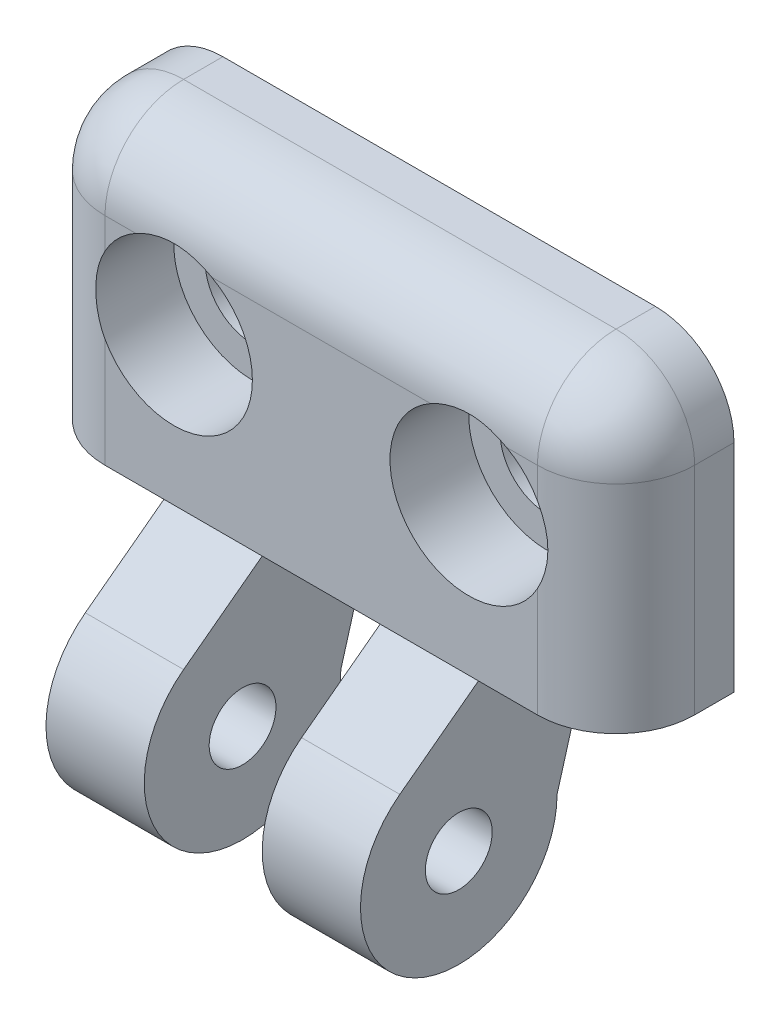
ISO-10303-21;
HEADER;
FILE_DESCRIPTION(('STEP AP214'),'2;1');
FILE_NAME('part.step','',(''),(''),'','','');
FILE_SCHEMA(('AUTOMOTIVE_DESIGN { 1 0 10303 214 1 1 1 1 }'));
ENDSEC;
DATA;
#1=APPLICATION_CONTEXT('core data for automotive mechanical design processes');
#2=APPLICATION_PROTOCOL_DEFINITION('international standard','automotive_design',2000,#1);
#3=PRODUCT_CONTEXT('',#1,'mechanical');
#4=PRODUCT('Part','Part','',(#3));
#5=PRODUCT_RELATED_PRODUCT_CATEGORY('part','',(#4));
#6=PRODUCT_DEFINITION_FORMATION('','',#4);
#7=PRODUCT_DEFINITION_CONTEXT('part definition',#1,'design');
#8=PRODUCT_DEFINITION('design','',#6,#7);
#9=PRODUCT_DEFINITION_SHAPE('','',#8);
#10=(LENGTH_UNIT() NAMED_UNIT(*) SI_UNIT(.MILLI.,.METRE.));
#11=(NAMED_UNIT(*) PLANE_ANGLE_UNIT() SI_UNIT($,.RADIAN.));
#12=(NAMED_UNIT(*) SI_UNIT($,.STERADIAN.) SOLID_ANGLE_UNIT());
#13=UNCERTAINTY_MEASURE_WITH_UNIT(LENGTH_MEASURE(1.E-05),#10,'distance_accuracy_value','');
#14=(GEOMETRIC_REPRESENTATION_CONTEXT(3) GLOBAL_UNCERTAINTY_ASSIGNED_CONTEXT((#13)) GLOBAL_UNIT_ASSIGNED_CONTEXT((#10,
#11,#12)) REPRESENTATION_CONTEXT('',''));
#15=CARTESIAN_POINT('',(0.,0.,0.));
#16=DIRECTION('',(0.,0.,1.));
#17=DIRECTION('',(1.,0.,0.));
#18=AXIS2_PLACEMENT_3D('',#15,#16,#17);
#19=CARTESIAN_POINT('',(0.,0.,6.));
#20=DIRECTION('',(0.,0.,-1.));
#21=DIRECTION('',(-1.,0.,0.));
#22=AXIS2_PLACEMENT_3D('',#19,#20,#21);
#23=PLANE('',#22);
#24=CARTESIAN_POINT('',(7.5,7.5,6.));
#25=DIRECTION('',(0.,0.,1.));
#26=DIRECTION('',(1.,0.,0.));
#27=AXIS2_PLACEMENT_3D('',#24,#25,#26);
#28=CIRCLE('',#27,3.99999999999999);
#29=CARTESIAN_POINT('',(4.,5.56350832689631,6.));
#30=VERTEX_POINT('',#29);
#31=CARTESIAN_POINT('',(9.43649167310369,11.,6.));
#32=VERTEX_POINT('',#31);
#33=EDGE_CURVE('E411',#30,#32,#28,.T.);
#34=ORIENTED_EDGE('',*,*,#33,.F.);
#35=DIRECTION('',(0.,-1.,0.));
#36=VECTOR('',#35,1.);
#37=CARTESIAN_POINT('',(4.,0.,6.));
#38=LINE('',#37,#36);
#39=CARTESIAN_POINT('',(4.,0.,6.));
#40=VERTEX_POINT('',#39);
#41=EDGE_CURVE('E256',#30,#40,#38,.T.);
#42=ORIENTED_EDGE('',*,*,#41,.T.);
#43=DIRECTION('',(1.,0.,0.));
#44=VECTOR('',#43,1.);
#45=CARTESIAN_POINT('',(0.,0.,6.));
#46=LINE('',#45,#44);
#47=CARTESIAN_POINT('',(6.99999999999999,0.,6.));
#48=VERTEX_POINT('',#47);
#49=EDGE_CURVE('E231',#40,#48,#46,.T.);
#50=ORIENTED_EDGE('',*,*,#49,.T.);
#51=CARTESIAN_POINT('',(12.,0.,6.));
#52=VERTEX_POINT('',#51);
#53=EDGE_CURVE('E435',#48,#52,#46,.T.);
#54=ORIENTED_EDGE('',*,*,#53,.T.);
#55=CARTESIAN_POINT('',(18.,0.,6.));
#56=VERTEX_POINT('',#55);
#57=EDGE_CURVE('E437',#52,#56,#46,.T.);
#58=ORIENTED_EDGE('',*,*,#57,.T.);
#59=CARTESIAN_POINT('',(23.,0.,6.));
#60=VERTEX_POINT('',#59);
#61=EDGE_CURVE('E438',#56,#60,#46,.T.);
#62=ORIENTED_EDGE('',*,*,#61,.T.);
#63=CARTESIAN_POINT('',(26.,0.,6.));
#64=VERTEX_POINT('',#63);
#65=EDGE_CURVE('E225',#60,#64,#46,.T.);
#66=ORIENTED_EDGE('',*,*,#65,.T.);
#67=DIRECTION('',(0.,1.,0.));
#68=VECTOR('',#67,1.);
#69=CARTESIAN_POINT('',(26.,0.,6.));
#70=LINE('',#69,#68);
#71=CARTESIAN_POINT('',(26.,5.56350832689631,6.));
#72=VERTEX_POINT('',#71);
#73=EDGE_CURVE('E254',#64,#72,#70,.T.);
#74=ORIENTED_EDGE('',*,*,#73,.T.);
#75=CARTESIAN_POINT('',(22.5,7.5,6.));
#76=DIRECTION('',(0.,0.,1.));
#77=DIRECTION('',(1.,0.,0.));
#78=AXIS2_PLACEMENT_3D('',#75,#76,#77);
#79=CIRCLE('',#78,3.99999999999999);
#80=CARTESIAN_POINT('',(20.5635083268963,11.,6.));
#81=VERTEX_POINT('',#80);
#82=EDGE_CURVE('E401',#81,#72,#79,.T.);
#83=ORIENTED_EDGE('',*,*,#82,.F.);
#84=DIRECTION('',(-1.,0.,0.));
#85=VECTOR('',#84,1.);
#86=CARTESIAN_POINT('',(0.,11.,6.));
#87=LINE('',#86,#85);
#88=EDGE_CURVE('E248',#81,#32,#87,.T.);
#89=ORIENTED_EDGE('',*,*,#88,.T.);
#90=EDGE_LOOP('',(#34,#42,#50,#54,#58,#62,#66,#74,#83,#89));
#91=FACE_BOUND('',#90,.T.);
#92=ADVANCED_FACE('F34',(#91),#23,.F.);
#93=CARTESIAN_POINT('',(26.,9.43649167310369,6.));
#94=VERTEX_POINT('',#93);
#95=CARTESIAN_POINT('',(24.4364916731037,11.,6.));
#96=VERTEX_POINT('',#95);
#97=EDGE_CURVE('E404',#94,#96,#79,.T.);
#98=ORIENTED_EDGE('',*,*,#97,.F.);
#99=DIRECTION('',(0.,1.,0.));
#100=VECTOR('',#99,1.);
#101=CARTESIAN_POINT('',(26.,0.,6.));
#102=LINE('',#101,#100);
#103=CARTESIAN_POINT('',(26.,11.,6.));
#104=VERTEX_POINT('',#103);
#105=EDGE_CURVE('E252',#94,#104,#102,.T.);
#106=ORIENTED_EDGE('',*,*,#105,.T.);
#107=DIRECTION('',(-1.,0.,0.));
#108=VECTOR('',#107,1.);
#109=CARTESIAN_POINT('',(0.,11.,6.));
#110=LINE('',#109,#108);
#111=EDGE_CURVE('E250',#104,#96,#110,.T.);
#112=ORIENTED_EDGE('',*,*,#111,.T.);
#113=EDGE_LOOP('',(#98,#106,#112));
#114=FACE_BOUND('',#113,.T.);
#115=ADVANCED_FACE('F330',(#114),#23,.F.);
#116=CARTESIAN_POINT('',(-16.9705627484771,0.,0.));
#117=DIRECTION('',(0.,-0.274721127897378,-0.961523947640823));
#118=DIRECTION('',(0.,0.961523947640823,-0.274721127897378));
#119=AXIS2_PLACEMENT_3D('',#116,#117,#118);
#120=PLANE('',#119);
#121=DIRECTION('',(0.,0.961523947640823,-0.274721127897378));
#122=VECTOR('',#121,1.);
#123=CARTESIAN_POINT('',(23.,0.,0.));
#124=LINE('',#123,#122);
#125=CARTESIAN_POINT('',(23.,-7.,2.));
#126=VERTEX_POINT('',#125);
#127=CARTESIAN_POINT('',(23.,0.,0.));
#128=VERTEX_POINT('',#127);
#129=EDGE_CURVE('E468',#126,#128,#124,.T.);
#130=ORIENTED_EDGE('',*,*,#129,.F.);
#131=DIRECTION('',(1.,0.,0.));
#132=VECTOR('',#131,1.);
#133=CARTESIAN_POINT('',(-16.9705627484771,-7.,2.));
#134=LINE('',#133,#132);
#135=CARTESIAN_POINT('',(18.,-7.,2.));
#136=VERTEX_POINT('',#135);
#137=EDGE_CURVE('E201',#136,#126,#134,.T.);
#138=ORIENTED_EDGE('',*,*,#137,.F.);
#139=DIRECTION('',(0.,-0.961523947640823,0.274721127897378));
#140=VECTOR('',#139,1.);
#141=CARTESIAN_POINT('',(18.,0.,0.));
#142=LINE('',#141,#140);
#143=CARTESIAN_POINT('',(18.,0.,0.));
#144=VERTEX_POINT('',#143);
#145=EDGE_CURVE('E187',#144,#136,#142,.T.);
#146=ORIENTED_EDGE('',*,*,#145,.F.);
#147=DIRECTION('',(1.,0.,0.));
#148=VECTOR('',#147,1.);
#149=CARTESIAN_POINT('',(0.,0.,0.));
#150=LINE('',#149,#148);
#151=EDGE_CURVE('E199',#144,#128,#150,.T.);
#152=ORIENTED_EDGE('',*,*,#151,.T.);
#153=EDGE_LOOP('',(#130,#138,#146,#152));
#154=FACE_BOUND('',#153,.T.);
#155=ADVANCED_FACE('F198',(#154),#120,.T.);
#156=CARTESIAN_POINT('',(-16.9705627484771,-7.,7.));
#157=DIRECTION('',(1.,0.,0.));
#158=DIRECTION('',(0.,0.,-1.));
#159=AXIS2_PLACEMENT_3D('',#156,#157,#158);
#160=CYLINDRICAL_SURFACE('',#159,5.);
#161=DIRECTION('',(1.,0.,0.));
#162=VECTOR('',#161,1.);
#163=CARTESIAN_POINT('',(-16.9705627484771,-3.,10.));
#164=LINE('',#163,#162);
#165=CARTESIAN_POINT('',(6.99999999999999,-3.,10.));
#166=VERTEX_POINT('',#165);
#167=CARTESIAN_POINT('',(12.,-3.,10.));
#168=VERTEX_POINT('',#167);
#169=EDGE_CURVE('E452',#166,#168,#164,.T.);
#170=ORIENTED_EDGE('',*,*,#169,.F.);
#171=CARTESIAN_POINT('',(6.99999999999999,-7.,7.));
#172=DIRECTION('',(1.,0.,0.));
#173=DIRECTION('',(0.,0.,-1.));
#174=AXIS2_PLACEMENT_3D('',#171,#172,#173);
#175=CIRCLE('',#174,5.);
#176=CARTESIAN_POINT('',(6.99999999999999,-7.,2.));
#177=VERTEX_POINT('',#176);
#178=EDGE_CURVE('E460',#177,#166,#175,.F.);
#179=ORIENTED_EDGE('',*,*,#178,.F.);
#180=CARTESIAN_POINT('',(12.,-7.,2.));
#181=VERTEX_POINT('',#180);
#182=EDGE_CURVE('E412',#177,#181,#134,.T.);
#183=ORIENTED_EDGE('',*,*,#182,.T.);
#184=CARTESIAN_POINT('',(12.,-7.,7.));
#185=DIRECTION('',(-1.,0.,0.));
#186=DIRECTION('',(0.,0.,1.));
#187=AXIS2_PLACEMENT_3D('',#184,#185,#186);
#188=CIRCLE('',#187,5.);
#189=EDGE_CURVE('E182',#168,#181,#188,.F.);
#190=ORIENTED_EDGE('',*,*,#189,.F.);
#191=EDGE_LOOP('',(#170,#179,#183,#190));
#192=FACE_BOUND('',#191,.T.);
#193=ADVANCED_FACE('F517',(#192),#160,.T.);
#194=CARTESIAN_POINT('',(-16.9705627484771,0.,6.));
#195=DIRECTION('',(0.,0.8,0.6));
#196=DIRECTION('',(0.,-0.6,0.8));
#197=AXIS2_PLACEMENT_3D('',#194,#195,#196);
#198=PLANE('',#197);
#199=DIRECTION('',(0.,-0.6,0.8));
#200=VECTOR('',#199,1.);
#201=CARTESIAN_POINT('',(23.,0.,6.));
#202=LINE('',#201,#200);
#203=CARTESIAN_POINT('',(23.,-3.,10.));
#204=VERTEX_POINT('',#203);
#205=EDGE_CURVE('E233',#60,#204,#202,.T.);
#206=ORIENTED_EDGE('',*,*,#205,.F.);
#207=ORIENTED_EDGE('',*,*,#61,.F.);
#208=DIRECTION('',(0.,0.6,-0.8));
#209=VECTOR('',#208,1.);
#210=CARTESIAN_POINT('',(18.,0.,6.));
#211=LINE('',#210,#209);
#212=CARTESIAN_POINT('',(18.,-3.,10.));
#213=VERTEX_POINT('',#212);
#214=EDGE_CURVE('E190',#213,#56,#211,.T.);
#215=ORIENTED_EDGE('',*,*,#214,.F.);
#216=EDGE_CURVE('E419',#213,#204,#164,.T.);
#217=ORIENTED_EDGE('',*,*,#216,.T.);
#218=EDGE_LOOP('',(#206,#207,#215,#217));
#219=FACE_BOUND('',#218,.T.);
#220=ADVANCED_FACE('F510',(#219),#198,.T.);
#221=CARTESIAN_POINT('',(0.,0.,6.));
#222=DIRECTION('',(1.,0.,0.));
#223=DIRECTION('',(0.,0.,-1.));
#224=AXIS2_PLACEMENT_3D('',#221,#222,#223);
#225=PLANE('',#224);
#226=DIRECTION('',(0.,0.,1.));
#227=VECTOR('',#226,1.);
#228=CARTESIAN_POINT('',(0.,0.,6.));
#229=LINE('',#228,#227);
#230=CARTESIAN_POINT('',(0.,0.,0.));
#231=VERTEX_POINT('',#230);
#232=CARTESIAN_POINT('',(0.,0.,2.));
#233=VERTEX_POINT('',#232);
#234=EDGE_CURVE('E464',#231,#233,#229,.T.);
#235=ORIENTED_EDGE('',*,*,#234,.T.);
#236=DIRECTION('',(0.,-1.,0.));
#237=VECTOR('',#236,1.);
#238=CARTESIAN_POINT('',(0.,0.,2.));
#239=LINE('',#238,#237);
#240=CARTESIAN_POINT('',(0.,11.,2.));
#241=VERTEX_POINT('',#240);
#242=EDGE_CURVE('E383',#233,#241,#239,.F.);
#243=ORIENTED_EDGE('',*,*,#242,.T.);
#244=DIRECTION('',(0.,0.,-1.));
#245=VECTOR('',#244,1.);
#246=CARTESIAN_POINT('',(0.,11.,6.));
#247=LINE('',#246,#245);
#248=CARTESIAN_POINT('',(0.,11.,0.));
#249=VERTEX_POINT('',#248);
#250=EDGE_CURVE('E380',#241,#249,#247,.T.);
#251=ORIENTED_EDGE('',*,*,#250,.T.);
#252=DIRECTION('',(0.,-1.,0.));
#253=VECTOR('',#252,1.);
#254=CARTESIAN_POINT('',(0.,0.,0.));
#255=LINE('',#254,#253);
#256=EDGE_CURVE('E211',#249,#231,#255,.T.);
#257=ORIENTED_EDGE('',*,*,#256,.T.);
#258=EDGE_LOOP('',(#235,#243,#251,#257));
#259=FACE_BOUND('',#258,.T.);
#260=ADVANCED_FACE('F525',(#259),#225,.F.);
#261=CARTESIAN_POINT('',(30.,0.,6.));
#262=DIRECTION('',(-1.,0.,0.));
#263=DIRECTION('',(0.,0.,1.));
#264=AXIS2_PLACEMENT_3D('',#261,#262,#263);
#265=PLANE('',#264);
#266=DIRECTION('',(0.,1.,0.));
#267=VECTOR('',#266,1.);
#268=CARTESIAN_POINT('',(30.,0.,0.));
#269=LINE('',#268,#267);
#270=CARTESIAN_POINT('',(30.,0.,0.));
#271=VERTEX_POINT('',#270);
#272=CARTESIAN_POINT('',(30.,11.,0.));
#273=VERTEX_POINT('',#272);
#274=EDGE_CURVE('E217',#271,#273,#269,.T.);
#275=ORIENTED_EDGE('',*,*,#274,.T.);
#276=DIRECTION('',(0.,0.,-1.));
#277=VECTOR('',#276,1.);
#278=CARTESIAN_POINT('',(30.,11.,6.));
#279=LINE('',#278,#277);
#280=CARTESIAN_POINT('',(30.,11.,2.));
#281=VERTEX_POINT('',#280);
#282=EDGE_CURVE('E51',#273,#281,#279,.F.);
#283=ORIENTED_EDGE('',*,*,#282,.T.);
#284=DIRECTION('',(0.,1.,0.));
#285=VECTOR('',#284,1.);
#286=CARTESIAN_POINT('',(30.,0.,2.));
#287=LINE('',#286,#285);
#288=CARTESIAN_POINT('',(30.,0.,2.));
#289=VERTEX_POINT('',#288);
#290=EDGE_CURVE('E55',#281,#289,#287,.F.);
#291=ORIENTED_EDGE('',*,*,#290,.T.);
#292=DIRECTION('',(0.,0.,-1.));
#293=VECTOR('',#292,1.);
#294=CARTESIAN_POINT('',(30.,0.,16.1355840721552));
#295=LINE('',#294,#293);
#296=EDGE_CURVE('E478',#289,#271,#295,.T.);
#297=ORIENTED_EDGE('',*,*,#296,.T.);
#298=EDGE_LOOP('',(#275,#283,#291,#297));
#299=FACE_BOUND('',#298,.T.);
#300=ADVANCED_FACE('F349',(#299),#265,.F.);
#301=CARTESIAN_POINT('',(0.,15.,6.));
#302=DIRECTION('',(0.,-1.,0.));
#303=DIRECTION('',(0.,0.,-1.));
#304=AXIS2_PLACEMENT_3D('',#301,#302,#303);
#305=PLANE('',#304);
#306=DIRECTION('',(-1.,0.,0.));
#307=VECTOR('',#306,1.);
#308=CARTESIAN_POINT('',(0.,15.,0.));
#309=LINE('',#308,#307);
#310=CARTESIAN_POINT('',(26.,15.,0.));
#311=VERTEX_POINT('',#310);
#312=CARTESIAN_POINT('',(4.,15.,0.));
#313=VERTEX_POINT('',#312);
#314=EDGE_CURVE('E223',#311,#313,#309,.T.);
#315=ORIENTED_EDGE('',*,*,#314,.T.);
#316=DIRECTION('',(0.,0.,-1.));
#317=VECTOR('',#316,1.);
#318=CARTESIAN_POINT('',(4.,15.,6.));
#319=LINE('',#318,#317);
#320=CARTESIAN_POINT('',(4.,15.,2.));
#321=VERTEX_POINT('',#320);
#322=EDGE_CURVE('E394',#313,#321,#319,.F.);
#323=ORIENTED_EDGE('',*,*,#322,.T.);
#324=DIRECTION('',(-1.,0.,0.));
#325=VECTOR('',#324,1.);
#326=CARTESIAN_POINT('',(0.,15.,2.));
#327=LINE('',#326,#325);
#328=CARTESIAN_POINT('',(26.,15.,2.));
#329=VERTEX_POINT('',#328);
#330=EDGE_CURVE('E364',#321,#329,#327,.F.);
#331=ORIENTED_EDGE('',*,*,#330,.T.);
#332=DIRECTION('',(0.,0.,-1.));
#333=VECTOR('',#332,1.);
#334=CARTESIAN_POINT('',(26.,15.,6.));
#335=LINE('',#334,#333);
#336=EDGE_CURVE('E392',#329,#311,#335,.T.);
#337=ORIENTED_EDGE('',*,*,#336,.T.);
#338=EDGE_LOOP('',(#315,#323,#331,#337));
#339=FACE_BOUND('',#338,.T.);
#340=ADVANCED_FACE('F341',(#339),#305,.F.);
#341=DIRECTION('',(-1.,0.,0.));
#342=VECTOR('',#341,1.);
#343=CARTESIAN_POINT('',(0.,11.,6.));
#344=LINE('',#343,#342);
#345=CARTESIAN_POINT('',(5.56350832689631,11.,6.));
#346=VERTEX_POINT('',#345);
#347=CARTESIAN_POINT('',(4.,11.,6.));
#348=VERTEX_POINT('',#347);
#349=EDGE_CURVE('E239',#346,#348,#344,.T.);
#350=ORIENTED_EDGE('',*,*,#349,.T.);
#351=DIRECTION('',(0.,-1.,0.));
#352=VECTOR('',#351,1.);
#353=CARTESIAN_POINT('',(4.,0.,6.));
#354=LINE('',#353,#352);
#355=CARTESIAN_POINT('',(4.,9.43649167310369,6.));
#356=VERTEX_POINT('',#355);
#357=EDGE_CURVE('E245',#348,#356,#354,.T.);
#358=ORIENTED_EDGE('',*,*,#357,.T.);
#359=EDGE_CURVE('E357',#346,#356,#28,.T.);
#360=ORIENTED_EDGE('',*,*,#359,.F.);
#361=EDGE_LOOP('',(#350,#358,#360));
#362=FACE_BOUND('',#361,.T.);
#363=ADVANCED_FACE('F333',(#362),#23,.F.);
#364=CARTESIAN_POINT('',(0.,0.,0.));
#365=DIRECTION('',(0.,0.,-1.));
#366=DIRECTION('',(-1.,0.,0.));
#367=AXIS2_PLACEMENT_3D('',#364,#365,#366);
#368=PLANE('',#367);
#369=CARTESIAN_POINT('',(7.5,7.5,0.));
#370=DIRECTION('',(0.,0.,1.));
#371=DIRECTION('',(1.,0.,0.));
#372=AXIS2_PLACEMENT_3D('',#369,#370,#371);
#373=CIRCLE('',#372,2.4);
#374=CARTESIAN_POINT('',(9.9,7.5,0.));
#375=VERTEX_POINT('',#374);
#376=EDGE_CURVE('E409',#375,#375,#373,.T.);
#377=ORIENTED_EDGE('',*,*,#376,.T.);
#378=EDGE_LOOP('',(#377));
#379=FACE_BOUND('',#378,.T.);
#380=CARTESIAN_POINT('',(22.5,7.5,0.));
#381=DIRECTION('',(0.,0.,1.));
#382=DIRECTION('',(1.,0.,0.));
#383=AXIS2_PLACEMENT_3D('',#380,#381,#382);
#384=CIRCLE('',#383,2.4);
#385=CARTESIAN_POINT('',(24.9,7.5,0.));
#386=VERTEX_POINT('',#385);
#387=EDGE_CURVE('E214',#386,#386,#384,.T.);
#388=ORIENTED_EDGE('',*,*,#387,.T.);
#389=EDGE_LOOP('',(#388));
#390=FACE_BOUND('',#389,.T.);
#391=ORIENTED_EDGE('',*,*,#256,.F.);
#392=CARTESIAN_POINT('',(4.,11.,0.));
#393=DIRECTION('',(0.,0.,-1.));
#394=DIRECTION('',(-1.,0.,0.));
#395=AXIS2_PLACEMENT_3D('',#392,#393,#394);
#396=CIRCLE('',#395,4.);
#397=EDGE_CURVE('E389',#249,#313,#396,.T.);
#398=ORIENTED_EDGE('',*,*,#397,.T.);
#399=ORIENTED_EDGE('',*,*,#314,.F.);
#400=CARTESIAN_POINT('',(26.,11.,0.));
#401=DIRECTION('',(0.,0.,-1.));
#402=DIRECTION('',(-1.,0.,0.));
#403=AXIS2_PLACEMENT_3D('',#400,#401,#402);
#404=CIRCLE('',#403,4.);
#405=EDGE_CURVE('E387',#311,#273,#404,.T.);
#406=ORIENTED_EDGE('',*,*,#405,.T.);
#407=ORIENTED_EDGE('',*,*,#274,.F.);
#408=DIRECTION('',(1.,0.,0.));
#409=VECTOR('',#408,1.);
#410=CARTESIAN_POINT('',(-16.9705627484771,0.,0.));
#411=LINE('',#410,#409);
#412=EDGE_CURVE('E202',#128,#271,#411,.T.);
#413=ORIENTED_EDGE('',*,*,#412,.F.);
#414=ORIENTED_EDGE('',*,*,#151,.F.);
#415=DIRECTION('',(1.,0.,0.));
#416=VECTOR('',#415,1.);
#417=CARTESIAN_POINT('',(-16.9705627484771,0.,0.));
#418=LINE('',#417,#416);
#419=CARTESIAN_POINT('',(12.,0.,0.));
#420=VERTEX_POINT('',#419);
#421=EDGE_CURVE('E171',#420,#144,#418,.T.);
#422=ORIENTED_EDGE('',*,*,#421,.F.);
#423=CARTESIAN_POINT('',(6.99999999999999,0.,0.));
#424=VERTEX_POINT('',#423);
#425=EDGE_CURVE('E210',#424,#420,#150,.T.);
#426=ORIENTED_EDGE('',*,*,#425,.F.);
#427=EDGE_CURVE('E213',#231,#424,#150,.T.);
#428=ORIENTED_EDGE('',*,*,#427,.F.);
#429=EDGE_LOOP('',(#391,#398,#399,#406,#407,#413,#414,#422,#426,#428));
#430=FACE_BOUND('',#429,.T.);
#431=ADVANCED_FACE('F207',(#379,#390,#430),#368,.T.);
#432=CARTESIAN_POINT('',(22.5,7.5,6.));
#433=DIRECTION('',(0.,0.,1.));
#434=DIRECTION('',(1.,0.,0.));
#435=AXIS2_PLACEMENT_3D('',#432,#433,#434);
#436=CYLINDRICAL_SURFACE('',#435,2.40000000000001);
#437=ORIENTED_EDGE('',*,*,#387,.F.);
#438=EDGE_LOOP('',(#437));
#439=FACE_BOUND('',#438,.T.);
#440=CARTESIAN_POINT('',(22.5,7.5,2.));
#441=DIRECTION('',(0.,0.,1.));
#442=DIRECTION('',(1.,0.,0.));
#443=AXIS2_PLACEMENT_3D('',#440,#441,#442);
#444=CIRCLE('',#443,2.40000000000001);
#445=CARTESIAN_POINT('',(24.9,7.5,2.));
#446=VERTEX_POINT('',#445);
#447=EDGE_CURVE('E430',#446,#446,#444,.T.);
#448=ORIENTED_EDGE('',*,*,#447,.T.);
#449=EDGE_LOOP('',(#448));
#450=FACE_BOUND('',#449,.T.);
#451=ADVANCED_FACE('F347',(#439,#450),#436,.F.);
#452=CARTESIAN_POINT('',(24.9,7.5,2.));
#453=DIRECTION('',(0.,0.,-1.));
#454=DIRECTION('',(-1.,0.,0.));
#455=AXIS2_PLACEMENT_3D('',#452,#453,#454);
#456=PLANE('',#455);
#457=ORIENTED_EDGE('',*,*,#447,.F.);
#458=EDGE_LOOP('',(#457));
#459=FACE_BOUND('',#458,.T.);
#460=CARTESIAN_POINT('',(22.5,7.5,2.));
#461=DIRECTION('',(0.,0.,1.));
#462=DIRECTION('',(1.,0.,0.));
#463=AXIS2_PLACEMENT_3D('',#460,#461,#462);
#464=CIRCLE('',#463,3.99999999999999);
#465=CARTESIAN_POINT('',(26.5,7.5,2.));
#466=VERTEX_POINT('',#465);
#467=EDGE_CURVE('E427',#466,#466,#464,.T.);
#468=ORIENTED_EDGE('',*,*,#467,.T.);
#469=EDGE_LOOP('',(#468));
#470=FACE_BOUND('',#469,.T.);
#471=ADVANCED_FACE('F297',(#459,#470),#456,.F.);
#472=CARTESIAN_POINT('',(22.5,7.5,6.));
#473=DIRECTION('',(0.,0.,1.));
#474=DIRECTION('',(1.,0.,0.));
#475=AXIS2_PLACEMENT_3D('',#472,#473,#474);
#476=CYLINDRICAL_SURFACE('',#475,3.99999999999999);
#477=ORIENTED_EDGE('',*,*,#467,.F.);
#478=EDGE_LOOP('',(#477));
#479=FACE_BOUND('',#478,.T.);
#480=ORIENTED_EDGE('',*,*,#82,.T.);
#481=CARTESIAN_POINT('',(26.,5.56350832689631,6.));
#482=CARTESIAN_POINT('',(26.0544180601739,5.66183890814639,5.99997756318304));
#483=CARTESIAN_POINT('',(26.1046650009676,5.7624612735533,5.99888845060216));
#484=CARTESIAN_POINT('',(26.1965098710818,5.96754706081492,5.99544039606056));
#485=CARTESIAN_POINT('',(26.2381087163422,6.07201007451705,5.99308158867125));
#486=CARTESIAN_POINT('',(26.3123021119348,6.28388396431068,5.98796144846458));
#487=CARTESIAN_POINT('',(26.3449111463069,6.39128978839502,5.98520077421808));
#488=CARTESIAN_POINT('',(26.4009929087305,6.60846763376983,5.9799500181671));
#489=CARTESIAN_POINT('',(26.4244656742693,6.7182396453496,5.97745993525237));
#490=CARTESIAN_POINT('',(26.4621194343287,6.93945810442888,5.97326121728072));
#491=CARTESIAN_POINT('',(26.4762941350681,7.05090563398141,5.97155311177347));
#492=CARTESIAN_POINT('',(26.4952262865008,7.27465966146156,5.96923702980138));
#493=CARTESIAN_POINT('',(26.4999795581466,7.38696651839733,5.96862954154575));
#494=CARTESIAN_POINT('',(26.5000203102222,7.6115822413931,5.96862440823199));
#495=CARTESIAN_POINT('',(26.4953077692872,7.72389110745706,5.96922676590452));
#496=CARTESIAN_POINT('',(26.4764567184001,7.9476526029821,5.97153351145775));
#497=CARTESIAN_POINT('',(26.4623223850268,8.05910558971146,5.97323741102672));
#498=CARTESIAN_POINT('',(26.4247286072661,8.28045652033506,5.97743177698388));
#499=CARTESIAN_POINT('',(26.4012655147867,8.39035383843952,5.97992255100776));
#500=CARTESIAN_POINT('',(26.3451828396174,8.60777976384693,5.98517725119262));
#501=CARTESIAN_POINT('',(26.3125632084015,8.71530835859333,5.98794117880116));
#502=CARTESIAN_POINT('',(26.2383285644286,8.92742383458565,5.99306867556837));
#503=CARTESIAN_POINT('',(26.1966989575423,9.03200562835848,5.99543158395539));
#504=CARTESIAN_POINT('',(26.104773569438,9.23732135792993,5.99888604345367));
#505=CARTESIAN_POINT('',(26.0544768780665,9.33805488825359,5.9999774609488));
#506=CARTESIAN_POINT('',(26.,9.43649167310369,6.));
#507=B_SPLINE_CURVE_WITH_KNOTS('',3,(#481,#482,#483,#484,#485,#486,#487,#488,#489,#490,#491,
#492,#493,#494,#495,#496,#497,#498,#499,#500,#501,#502,#503,#504,#505,#506),.UNSPECIFIED.,.F.,
.F.,(4,2,2,2,2,2,2,2,2,2,2,2,4),(0.,0.337028734288996,0.674021754874665,1.01046860914111,
1.34691408291181,1.68358705941703,2.02040934000031,2.35723238080592,2.69390621079963,
3.03071182971111,3.36751923359391,3.70487632786476,4.04226887050961),.UNSPECIFIED.);
#508=EDGE_CURVE('E43',#72,#94,#507,.T.);
#509=ORIENTED_EDGE('',*,*,#508,.T.);
#510=ORIENTED_EDGE('',*,*,#97,.T.);
#511=CARTESIAN_POINT('',(24.4364916731037,11.,6.));
#512=CARTESIAN_POINT('',(24.3381610918536,11.0544180601739,5.99997756318304));
#513=CARTESIAN_POINT('',(24.2375387264467,11.1046650009676,5.99888845060216));
#514=CARTESIAN_POINT('',(24.0324529391851,11.1965098710818,5.99544039606056));
#515=CARTESIAN_POINT('',(23.927989925483,11.2381087163422,5.99308158867125));
#516=CARTESIAN_POINT('',(23.7161160356893,11.3123021119348,5.98796144846458));
#517=CARTESIAN_POINT('',(23.608710211605,11.3449111463069,5.98520077421808));
#518=CARTESIAN_POINT('',(23.3915323662302,11.4009929087305,5.9799500181671));
#519=CARTESIAN_POINT('',(23.2817603546504,11.4244656742693,5.97745993525237));
#520=CARTESIAN_POINT('',(23.0605418955711,11.4621194343287,5.97326121728072));
#521=CARTESIAN_POINT('',(22.9490943660186,11.4762941350681,5.97155311177347));
#522=CARTESIAN_POINT('',(22.7253403385384,11.4952262865008,5.96923702980138));
#523=CARTESIAN_POINT('',(22.6130334816027,11.4999795581466,5.96862954154575));
#524=CARTESIAN_POINT('',(22.3884177586069,11.5000203102222,5.96862440823199));
#525=CARTESIAN_POINT('',(22.2761088925429,11.4953077692872,5.96922676590452));
#526=CARTESIAN_POINT('',(22.0523473970179,11.4764567184001,5.97153351145775));
#527=CARTESIAN_POINT('',(21.9408944102885,11.4623223850268,5.97323741102672));
#528=CARTESIAN_POINT('',(21.7195434796649,11.4247286072661,5.97743177698388));
#529=CARTESIAN_POINT('',(21.6096461615605,11.4012655147867,5.97992255100776));
#530=CARTESIAN_POINT('',(21.3922202361531,11.3451828396174,5.98517725119262));
#531=CARTESIAN_POINT('',(21.2846916414067,11.3125632084015,5.98794117880116));
#532=CARTESIAN_POINT('',(21.0725761654143,11.2383285644286,5.99306867556837));
#533=CARTESIAN_POINT('',(20.9679943716415,11.1966989575423,5.99543158395539));
#534=CARTESIAN_POINT('',(20.7626786420701,11.104773569438,5.99888604345367));
#535=CARTESIAN_POINT('',(20.6619451117464,11.0544768780665,5.9999774609488));
#536=CARTESIAN_POINT('',(20.5635083268963,11.,6.));
#537=B_SPLINE_CURVE_WITH_KNOTS('',3,(#511,#512,#513,#514,#515,#516,#517,#518,#519,#520,#521,
#522,#523,#524,#525,#526,#527,#528,#529,#530,#531,#532,#533,#534,#535,#536),.UNSPECIFIED.,.F.,
.F.,(4,2,2,2,2,2,2,2,2,2,2,2,4),(0.,0.337028734288995,0.674021754874665,1.01046860914111,
1.34691408291181,1.68358705941704,2.02040934000032,2.35723238080593,2.69390621079964,
3.03071182971111,3.36751923359391,3.70487632786477,4.04226887050962),.UNSPECIFIED.);
#538=EDGE_CURVE('E302',#96,#81,#537,.T.);
#539=ORIENTED_EDGE('',*,*,#538,.T.);
#540=EDGE_LOOP('',(#480,#509,#510,#539));
#541=FACE_BOUND('',#540,.T.);
#542=ADVANCED_FACE('F292',(#479,#541),#476,.F.);
#543=CARTESIAN_POINT('',(7.5,7.5,6.));
#544=DIRECTION('',(0.,0.,1.));
#545=DIRECTION('',(1.,0.,0.));
#546=AXIS2_PLACEMENT_3D('',#543,#544,#545);
#547=CYLINDRICAL_SURFACE('',#546,2.40000000000001);
#548=ORIENTED_EDGE('',*,*,#376,.F.);
#549=EDGE_LOOP('',(#548));
#550=FACE_BOUND('',#549,.T.);
#551=CARTESIAN_POINT('',(7.5,7.5,2.));
#552=DIRECTION('',(0.,0.,1.));
#553=DIRECTION('',(1.,0.,0.));
#554=AXIS2_PLACEMENT_3D('',#551,#552,#553);
#555=CIRCLE('',#554,2.40000000000001);
#556=CARTESIAN_POINT('',(9.90000000000001,7.5,2.));
#557=VERTEX_POINT('',#556);
#558=EDGE_CURVE('E422',#557,#557,#555,.T.);
#559=ORIENTED_EDGE('',*,*,#558,.T.);
#560=EDGE_LOOP('',(#559));
#561=FACE_BOUND('',#560,.T.);
#562=ADVANCED_FACE('F288',(#550,#561),#547,.F.);
#563=CARTESIAN_POINT('',(9.90000000000001,7.5,2.));
#564=DIRECTION('',(0.,0.,-1.));
#565=DIRECTION('',(-1.,0.,0.));
#566=AXIS2_PLACEMENT_3D('',#563,#564,#565);
#567=PLANE('',#566);
#568=ORIENTED_EDGE('',*,*,#558,.F.);
#569=EDGE_LOOP('',(#568));
#570=FACE_BOUND('',#569,.T.);
#571=CARTESIAN_POINT('',(7.5,7.5,2.));
#572=DIRECTION('',(0.,0.,1.));
#573=DIRECTION('',(1.,0.,0.));
#574=AXIS2_PLACEMENT_3D('',#571,#572,#573);
#575=CIRCLE('',#574,3.99999999999999);
#576=CARTESIAN_POINT('',(11.5,7.5,2.));
#577=VERTEX_POINT('',#576);
#578=EDGE_CURVE('E414',#577,#577,#575,.T.);
#579=ORIENTED_EDGE('',*,*,#578,.T.);
#580=EDGE_LOOP('',(#579));
#581=FACE_BOUND('',#580,.T.);
#582=ADVANCED_FACE('F281',(#570,#581),#567,.F.);
#583=CARTESIAN_POINT('',(7.5,7.5,6.));
#584=DIRECTION('',(0.,0.,1.));
#585=DIRECTION('',(1.,0.,0.));
#586=AXIS2_PLACEMENT_3D('',#583,#584,#585);
#587=CYLINDRICAL_SURFACE('',#586,3.99999999999999);
#588=ORIENTED_EDGE('',*,*,#578,.F.);
#589=EDGE_LOOP('',(#588));
#590=FACE_BOUND('',#589,.T.);
#591=ORIENTED_EDGE('',*,*,#359,.T.);
#592=CARTESIAN_POINT('',(4.,9.43649167310369,6.));
#593=CARTESIAN_POINT('',(3.94558193982612,9.33816109185361,5.99997756318304));
#594=CARTESIAN_POINT('',(3.89533499903245,9.2375387264467,5.99888845060216));
#595=CARTESIAN_POINT('',(3.80349012891823,9.03245293918508,5.99544039606056));
#596=CARTESIAN_POINT('',(3.76189128365776,8.92798992548295,5.99308158867125));
#597=CARTESIAN_POINT('',(3.68769788806517,8.71611603568932,5.98796144846458));
#598=CARTESIAN_POINT('',(3.65508885369309,8.60871021160498,5.98520077421808));
#599=CARTESIAN_POINT('',(3.59900709126947,8.39153236623017,5.9799500181671));
#600=CARTESIAN_POINT('',(3.57553432573074,8.2817603546504,5.97745993525237));
#601=CARTESIAN_POINT('',(3.53788056567126,8.06054189557112,5.97326121728072));
#602=CARTESIAN_POINT('',(3.52370586493193,7.94909436601859,5.97155311177347));
#603=CARTESIAN_POINT('',(3.50477371349923,7.72534033853844,5.96923702980138));
#604=CARTESIAN_POINT('',(3.50002044185337,7.61303348160267,5.96862954154575));
#605=CARTESIAN_POINT('',(3.49997968977777,7.3884177586069,5.96862440823199));
#606=CARTESIAN_POINT('',(3.50469223071275,7.27610889254294,5.96922676590452));
#607=CARTESIAN_POINT('',(3.5235432815999,7.0523473970179,5.97153351145775));
#608=CARTESIAN_POINT('',(3.53767761497322,6.94089441028854,5.97323741102672));
#609=CARTESIAN_POINT('',(3.5752713927339,6.71954347966493,5.97743177698388));
#610=CARTESIAN_POINT('',(3.59873448521334,6.60964616156048,5.97992255100776));
#611=CARTESIAN_POINT('',(3.65481716038259,6.39222023615307,5.98517725119262));
#612=CARTESIAN_POINT('',(3.68743679159848,6.28469164140667,5.98794117880116));
#613=CARTESIAN_POINT('',(3.76167143557143,6.07257616541435,5.99306867556837));
#614=CARTESIAN_POINT('',(3.80330104245771,5.96799437164152,5.99543158395539));
#615=CARTESIAN_POINT('',(3.89522643056201,5.76267864207007,5.99888604345367));
#616=CARTESIAN_POINT('',(3.94552312193351,5.66194511174641,5.9999774609488));
#617=CARTESIAN_POINT('',(4.,5.56350832689631,6.));
#618=B_SPLINE_CURVE_WITH_KNOTS('',3,(#592,#593,#594,#595,#596,#597,#598,#599,#600,#601,#602,
#603,#604,#605,#606,#607,#608,#609,#610,#611,#612,#613,#614,#615,#616,#617),.UNSPECIFIED.,.F.,
.F.,(4,2,2,2,2,2,2,2,2,2,2,2,4),(0.,0.337028734288997,0.674021754874665,1.01046860914111,
1.34691408291181,1.68358705941703,2.02040934000031,2.35723238080592,2.69390621079963,
3.0307118297111,3.36751923359391,3.70487632786476,4.04226887050961),.UNSPECIFIED.);
#619=EDGE_CURVE('E265',#356,#30,#618,.T.);
#620=ORIENTED_EDGE('',*,*,#619,.T.);
#621=ORIENTED_EDGE('',*,*,#33,.T.);
#622=CARTESIAN_POINT('',(9.43649167310369,11.,6.));
#623=CARTESIAN_POINT('',(9.33816109185361,11.0544180601739,5.99997756318304));
#624=CARTESIAN_POINT('',(9.2375387264467,11.1046650009676,5.99888845060216));
#625=CARTESIAN_POINT('',(9.03245293918508,11.1965098710818,5.99544039606056));
#626=CARTESIAN_POINT('',(8.92798992548295,11.2381087163422,5.99308158867125));
#627=CARTESIAN_POINT('',(8.71611603568932,11.3123021119348,5.98796144846458));
#628=CARTESIAN_POINT('',(8.60871021160498,11.3449111463069,5.98520077421808));
#629=CARTESIAN_POINT('',(8.39153236623017,11.4009929087305,5.9799500181671));
#630=CARTESIAN_POINT('',(8.2817603546504,11.4244656742693,5.97745993525237));
#631=CARTESIAN_POINT('',(8.06054189557112,11.4621194343287,5.97326121728072));
#632=CARTESIAN_POINT('',(7.94909436601859,11.4762941350681,5.97155311177347));
#633=CARTESIAN_POINT('',(7.72534033853844,11.4952262865008,5.96923702980138));
#634=CARTESIAN_POINT('',(7.61303348160267,11.4999795581466,5.96862954154575));
#635=CARTESIAN_POINT('',(7.3884177586069,11.5000203102222,5.96862440823199));
#636=CARTESIAN_POINT('',(7.27610889254294,11.4953077692872,5.96922676590452));
#637=CARTESIAN_POINT('',(7.0523473970179,11.4764567184001,5.97153351145775));
#638=CARTESIAN_POINT('',(6.94089441028854,11.4623223850268,5.97323741102672));
#639=CARTESIAN_POINT('',(6.71954347966493,11.4247286072661,5.97743177698388));
#640=CARTESIAN_POINT('',(6.60964616156048,11.4012655147867,5.97992255100776));
#641=CARTESIAN_POINT('',(6.39222023615307,11.3451828396174,5.98517725119262));
#642=CARTESIAN_POINT('',(6.28469164140667,11.3125632084015,5.98794117880116));
#643=CARTESIAN_POINT('',(6.07257616541435,11.2383285644286,5.99306867556837));
#644=CARTESIAN_POINT('',(5.96799437164152,11.1966989575423,5.99543158395539));
#645=CARTESIAN_POINT('',(5.76267864207007,11.104773569438,5.99888604345367));
#646=CARTESIAN_POINT('',(5.66194511174641,11.0544768780665,5.9999774609488));
#647=CARTESIAN_POINT('',(5.56350832689631,11.,6.));
#648=B_SPLINE_CURVE_WITH_KNOTS('',3,(#622,#623,#624,#625,#626,#627,#628,#629,#630,#631,#632,
#633,#634,#635,#636,#637,#638,#639,#640,#641,#642,#643,#644,#645,#646,#647),.UNSPECIFIED.,.F.,
.F.,(4,2,2,2,2,2,2,2,2,2,2,2,4),(0.,0.337028734288997,0.674021754874665,1.01046860914111,
1.34691408291181,1.68358705941703,2.02040934000031,2.35723238080592,2.69390621079963,
3.0307118297111,3.36751923359391,3.70487632786476,4.04226887050961),.UNSPECIFIED.);
#649=EDGE_CURVE('E258',#32,#346,#648,.T.);
#650=ORIENTED_EDGE('',*,*,#649,.T.);
#651=EDGE_LOOP('',(#591,#620,#621,#650));
#652=FACE_BOUND('',#651,.T.);
#653=ADVANCED_FACE('F275',(#590,#652),#587,.F.);
#654=DIRECTION('',(0.,-0.961523947640823,0.274721127897378));
#655=VECTOR('',#654,1.);
#656=CARTESIAN_POINT('',(6.99999999999999,0.,0.));
#657=LINE('',#656,#655);
#658=EDGE_CURVE('E456',#424,#177,#657,.T.);
#659=ORIENTED_EDGE('',*,*,#658,.F.);
#660=ORIENTED_EDGE('',*,*,#425,.T.);
#661=DIRECTION('',(0.,0.961523947640823,-0.274721127897378));
#662=VECTOR('',#661,1.);
#663=CARTESIAN_POINT('',(12.,0.,0.));
#664=LINE('',#663,#662);
#665=EDGE_CURVE('E447',#181,#420,#664,.T.);
#666=ORIENTED_EDGE('',*,*,#665,.F.);
#667=ORIENTED_EDGE('',*,*,#182,.F.);
#668=EDGE_LOOP('',(#659,#660,#666,#667));
#669=FACE_BOUND('',#668,.T.);
#670=ADVANCED_FACE('F280',(#669),#120,.T.);
#671=CARTESIAN_POINT('',(23.,-7.,7.));
#672=DIRECTION('',(-1.,0.,0.));
#673=DIRECTION('',(0.,0.,1.));
#674=AXIS2_PLACEMENT_3D('',#671,#672,#673);
#675=CIRCLE('',#674,5.);
#676=EDGE_CURVE('E470',#204,#126,#675,.F.);
#677=ORIENTED_EDGE('',*,*,#676,.F.);
#678=ORIENTED_EDGE('',*,*,#216,.F.);
#679=CARTESIAN_POINT('',(18.,-7.,7.));
#680=DIRECTION('',(1.,0.,0.));
#681=DIRECTION('',(0.,0.,-1.));
#682=AXIS2_PLACEMENT_3D('',#679,#680,#681);
#683=CIRCLE('',#682,5.);
#684=EDGE_CURVE('E203',#136,#213,#683,.F.);
#685=ORIENTED_EDGE('',*,*,#684,.F.);
#686=ORIENTED_EDGE('',*,*,#137,.T.);
#687=EDGE_LOOP('',(#677,#678,#685,#686));
#688=FACE_BOUND('',#687,.T.);
#689=ADVANCED_FACE('F509',(#688),#160,.T.);
#690=DIRECTION('',(0.,0.6,-0.8));
#691=VECTOR('',#690,1.);
#692=CARTESIAN_POINT('',(6.99999999999999,0.,6.));
#693=LINE('',#692,#691);
#694=EDGE_CURVE('E236',#166,#48,#693,.T.);
#695=ORIENTED_EDGE('',*,*,#694,.F.);
#696=ORIENTED_EDGE('',*,*,#169,.T.);
#697=DIRECTION('',(0.,-0.6,0.8));
#698=VECTOR('',#697,1.);
#699=CARTESIAN_POINT('',(12.,0.,6.));
#700=LINE('',#699,#698);
#701=EDGE_CURVE('E228',#52,#168,#700,.T.);
#702=ORIENTED_EDGE('',*,*,#701,.F.);
#703=ORIENTED_EDGE('',*,*,#53,.F.);
#704=EDGE_LOOP('',(#695,#696,#702,#703));
#705=FACE_BOUND('',#704,.T.);
#706=ADVANCED_FACE('F283',(#705),#198,.T.);
#707=CARTESIAN_POINT('',(18.,-12.,13.7314563138003));
#708=DIRECTION('',(1.,0.,0.));
#709=DIRECTION('',(0.,0.,-1.));
#710=AXIS2_PLACEMENT_3D('',#707,#708,#709);
#711=PLANE('',#710);
#712=CARTESIAN_POINT('',(18.,-7.,7.));
#713=DIRECTION('',(1.,0.,0.));
#714=DIRECTION('',(0.,0.,-1.));
#715=AXIS2_PLACEMENT_3D('',#712,#713,#714);
#716=CIRCLE('',#715,1.7);
#717=CARTESIAN_POINT('',(18.,-7.,5.3));
#718=VERTEX_POINT('',#717);
#719=EDGE_CURVE('E479',#718,#718,#716,.T.);
#720=ORIENTED_EDGE('',*,*,#719,.T.);
#721=EDGE_LOOP('',(#720));
#722=FACE_BOUND('',#721,.T.);
#723=ORIENTED_EDGE('',*,*,#145,.T.);
#724=ORIENTED_EDGE('',*,*,#684,.T.);
#725=ORIENTED_EDGE('',*,*,#214,.T.);
#726=DIRECTION('',(0.,0.,-1.));
#727=VECTOR('',#726,1.);
#728=CARTESIAN_POINT('',(18.,0.,13.7314563138003));
#729=LINE('',#728,#727);
#730=EDGE_CURVE('E174',#56,#144,#729,.T.);
#731=ORIENTED_EDGE('',*,*,#730,.T.);
#732=EDGE_LOOP('',(#723,#724,#725,#731));
#733=FACE_BOUND('',#732,.T.);
#734=ADVANCED_FACE('F186',(#722,#733),#711,.F.);
#735=CARTESIAN_POINT('',(12.,-12.,13.7314563138003));
#736=DIRECTION('',(-1.,0.,0.));
#737=DIRECTION('',(0.,0.,1.));
#738=AXIS2_PLACEMENT_3D('',#735,#736,#737);
#739=PLANE('',#738);
#740=CARTESIAN_POINT('',(12.,-7.,7.));
#741=DIRECTION('',(-1.,0.,0.));
#742=DIRECTION('',(0.,0.,1.));
#743=AXIS2_PLACEMENT_3D('',#740,#741,#742);
#744=CIRCLE('',#743,1.7);
#745=CARTESIAN_POINT('',(12.,-7.,8.7));
#746=VERTEX_POINT('',#745);
#747=EDGE_CURVE('E485',#746,#746,#744,.T.);
#748=ORIENTED_EDGE('',*,*,#747,.T.);
#749=EDGE_LOOP('',(#748));
#750=FACE_BOUND('',#749,.T.);
#751=ORIENTED_EDGE('',*,*,#665,.T.);
#752=DIRECTION('',(0.,0.,1.));
#753=VECTOR('',#752,1.);
#754=CARTESIAN_POINT('',(12.,0.,13.7314563138003));
#755=LINE('',#754,#753);
#756=EDGE_CURVE('E177',#420,#52,#755,.T.);
#757=ORIENTED_EDGE('',*,*,#756,.T.);
#758=ORIENTED_EDGE('',*,*,#701,.T.);
#759=ORIENTED_EDGE('',*,*,#189,.T.);
#760=EDGE_LOOP('',(#751,#757,#758,#759));
#761=FACE_BOUND('',#760,.T.);
#762=ADVANCED_FACE('F444',(#750,#761),#739,.F.);
#763=CARTESIAN_POINT('',(0.,0.,0.));
#764=DIRECTION('',(0.,1.,0.));
#765=DIRECTION('',(0.,0.,1.));
#766=AXIS2_PLACEMENT_3D('',#763,#764,#765);
#767=PLANE('',#766);
#768=ORIENTED_EDGE('',*,*,#421,.T.);
#769=ORIENTED_EDGE('',*,*,#730,.F.);
#770=ORIENTED_EDGE('',*,*,#57,.F.);
#771=ORIENTED_EDGE('',*,*,#756,.F.);
#772=EDGE_LOOP('',(#768,#769,#770,#771));
#773=FACE_BOUND('',#772,.T.);
#774=ADVANCED_FACE('F173',(#773),#767,.F.);
#775=CARTESIAN_POINT('',(23.,-12.,16.1355840721552));
#776=DIRECTION('',(-1.,0.,0.));
#777=DIRECTION('',(0.,0.,1.));
#778=AXIS2_PLACEMENT_3D('',#775,#776,#777);
#779=PLANE('',#778);
#780=CARTESIAN_POINT('',(23.,-7.,7.));
#781=DIRECTION('',(-1.,0.,0.));
#782=DIRECTION('',(0.,0.,1.));
#783=AXIS2_PLACEMENT_3D('',#780,#781,#782);
#784=CIRCLE('',#783,1.7);
#785=CARTESIAN_POINT('',(23.,-7.,8.7));
#786=VERTEX_POINT('',#785);
#787=EDGE_CURVE('E243',#786,#786,#784,.T.);
#788=ORIENTED_EDGE('',*,*,#787,.T.);
#789=EDGE_LOOP('',(#788));
#790=FACE_BOUND('',#789,.T.);
#791=ORIENTED_EDGE('',*,*,#129,.T.);
#792=DIRECTION('',(0.,0.,1.));
#793=VECTOR('',#792,1.);
#794=CARTESIAN_POINT('',(23.,0.,16.1355840721552));
#795=LINE('',#794,#793);
#796=EDGE_CURVE('E192',#128,#60,#795,.T.);
#797=ORIENTED_EDGE('',*,*,#796,.T.);
#798=ORIENTED_EDGE('',*,*,#205,.T.);
#799=ORIENTED_EDGE('',*,*,#676,.T.);
#800=EDGE_LOOP('',(#791,#797,#798,#799));
#801=FACE_BOUND('',#800,.T.);
#802=ADVANCED_FACE('F491',(#790,#801),#779,.F.);
#803=CARTESIAN_POINT('',(0.,0.,0.));
#804=DIRECTION('',(0.,1.,0.));
#805=DIRECTION('',(0.,0.,1.));
#806=AXIS2_PLACEMENT_3D('',#803,#804,#805);
#807=PLANE('',#806);
#808=ORIENTED_EDGE('',*,*,#296,.F.);
#809=CARTESIAN_POINT('',(26.,0.,2.));
#810=DIRECTION('',(0.,1.,0.));
#811=DIRECTION('',(0.,0.,1.));
#812=AXIS2_PLACEMENT_3D('',#809,#810,#811);
#813=CIRCLE('',#812,4.);
#814=EDGE_CURVE('E11',#289,#64,#813,.F.);
#815=ORIENTED_EDGE('',*,*,#814,.T.);
#816=ORIENTED_EDGE('',*,*,#65,.F.);
#817=ORIENTED_EDGE('',*,*,#796,.F.);
#818=ORIENTED_EDGE('',*,*,#412,.T.);
#819=EDGE_LOOP('',(#808,#815,#816,#817,#818));
#820=FACE_BOUND('',#819,.T.);
#821=ADVANCED_FACE('F596',(#820),#807,.F.);
#822=CARTESIAN_POINT('',(6.99999999999999,-12.,14.6056845895654));
#823=DIRECTION('',(1.,0.,0.));
#824=DIRECTION('',(0.,0.,-1.));
#825=AXIS2_PLACEMENT_3D('',#822,#823,#824);
#826=PLANE('',#825);
#827=CARTESIAN_POINT('',(6.99999999999999,-7.,7.));
#828=DIRECTION('',(1.,0.,0.));
#829=DIRECTION('',(0.,0.,-1.));
#830=AXIS2_PLACEMENT_3D('',#827,#828,#829);
#831=CIRCLE('',#830,1.7);
#832=CARTESIAN_POINT('',(6.99999999999999,-7.,5.3));
#833=VERTEX_POINT('',#832);
#834=EDGE_CURVE('E240',#833,#833,#831,.T.);
#835=ORIENTED_EDGE('',*,*,#834,.T.);
#836=EDGE_LOOP('',(#835));
#837=FACE_BOUND('',#836,.T.);
#838=ORIENTED_EDGE('',*,*,#658,.T.);
#839=ORIENTED_EDGE('',*,*,#178,.T.);
#840=ORIENTED_EDGE('',*,*,#694,.T.);
#841=DIRECTION('',(0.,0.,-1.));
#842=VECTOR('',#841,1.);
#843=CARTESIAN_POINT('',(6.99999999999999,0.,14.6056845895654));
#844=LINE('',#843,#842);
#845=EDGE_CURVE('E476',#48,#424,#844,.T.);
#846=ORIENTED_EDGE('',*,*,#845,.T.);
#847=EDGE_LOOP('',(#838,#839,#840,#846));
#848=FACE_BOUND('',#847,.T.);
#849=ADVANCED_FACE('F601',(#837,#848),#826,.F.);
#850=CARTESIAN_POINT('',(0.,0.,0.));
#851=DIRECTION('',(0.,1.,0.));
#852=DIRECTION('',(0.,0.,1.));
#853=AXIS2_PLACEMENT_3D('',#850,#851,#852);
#854=PLANE('',#853);
#855=ORIENTED_EDGE('',*,*,#49,.F.);
#856=CARTESIAN_POINT('',(4.,0.,2.));
#857=DIRECTION('',(0.,1.,0.));
#858=DIRECTION('',(0.,0.,1.));
#859=AXIS2_PLACEMENT_3D('',#856,#857,#858);
#860=CIRCLE('',#859,4.);
#861=EDGE_CURVE('E379',#40,#233,#860,.F.);
#862=ORIENTED_EDGE('',*,*,#861,.T.);
#863=ORIENTED_EDGE('',*,*,#234,.F.);
#864=ORIENTED_EDGE('',*,*,#427,.T.);
#865=ORIENTED_EDGE('',*,*,#845,.F.);
#866=EDGE_LOOP('',(#855,#862,#863,#864,#865));
#867=FACE_BOUND('',#866,.T.);
#868=ADVANCED_FACE('F611',(#867),#854,.F.);
#869=CARTESIAN_POINT('',(30.,-7.,7.));
#870=DIRECTION('',(-1.,0.,0.));
#871=DIRECTION('',(0.,0.,1.));
#872=AXIS2_PLACEMENT_3D('',#869,#870,#871);
#873=CYLINDRICAL_SURFACE('',#872,1.7);
#874=ORIENTED_EDGE('',*,*,#834,.F.);
#875=EDGE_LOOP('',(#874));
#876=FACE_BOUND('',#875,.T.);
#877=ORIENTED_EDGE('',*,*,#747,.F.);
#878=EDGE_LOOP('',(#877));
#879=FACE_BOUND('',#878,.T.);
#880=ADVANCED_FACE('F497',(#876,#879),#873,.F.);
#881=ORIENTED_EDGE('',*,*,#787,.F.);
#882=EDGE_LOOP('',(#881));
#883=FACE_BOUND('',#882,.T.);
#884=ORIENTED_EDGE('',*,*,#719,.F.);
#885=EDGE_LOOP('',(#884));
#886=FACE_BOUND('',#885,.T.);
#887=ADVANCED_FACE('F494',(#883,#886),#873,.F.);
#888=CARTESIAN_POINT('',(26.,11.,6.));
#889=DIRECTION('',(0.,0.,-1.));
#890=DIRECTION('',(-1.,0.,0.));
#891=AXIS2_PLACEMENT_3D('',#888,#889,#890);
#892=CYLINDRICAL_SURFACE('',#891,4.);
#893=ORIENTED_EDGE('',*,*,#405,.F.);
#894=ORIENTED_EDGE('',*,*,#336,.F.);
#895=CARTESIAN_POINT('',(26.,11.,2.));
#896=DIRECTION('',(0.,0.,1.));
#897=DIRECTION('',(1.,0.,0.));
#898=AXIS2_PLACEMENT_3D('',#895,#896,#897);
#899=CIRCLE('',#898,4.);
#900=EDGE_CURVE('E38',#281,#329,#899,.T.);
#901=ORIENTED_EDGE('',*,*,#900,.F.);
#902=ORIENTED_EDGE('',*,*,#282,.F.);
#903=EDGE_LOOP('',(#893,#894,#901,#902));
#904=FACE_BOUND('',#903,.T.);
#905=ADVANCED_FACE('F36',(#904),#892,.T.);
#906=CARTESIAN_POINT('',(26.,0.,2.));
#907=DIRECTION('',(0.,1.,0.));
#908=DIRECTION('',(0.,0.,1.));
#909=AXIS2_PLACEMENT_3D('',#906,#907,#908);
#910=CYLINDRICAL_SURFACE('',#909,4.);
#911=ORIENTED_EDGE('',*,*,#814,.F.);
#912=ORIENTED_EDGE('',*,*,#290,.F.);
#913=CARTESIAN_POINT('',(26.,11.,2.));
#914=DIRECTION('',(0.,1.,0.));
#915=DIRECTION('',(0.,0.,1.));
#916=AXIS2_PLACEMENT_3D('',#913,#914,#915);
#917=CIRCLE('',#916,4.);
#918=EDGE_CURVE('E747',#104,#281,#917,.T.);
#919=ORIENTED_EDGE('',*,*,#918,.F.);
#920=ORIENTED_EDGE('',*,*,#105,.F.);
#921=ORIENTED_EDGE('',*,*,#508,.F.);
#922=ORIENTED_EDGE('',*,*,#73,.F.);
#923=EDGE_LOOP('',(#911,#912,#919,#920,#921,#922));
#924=FACE_BOUND('',#923,.T.);
#925=ADVANCED_FACE('F312',(#924),#910,.T.);
#926=CARTESIAN_POINT('',(26.,11.,2.));
#927=DIRECTION('',(0.,0.,1.));
#928=DIRECTION('',(1.,0.,0.));
#929=AXIS2_PLACEMENT_3D('',#926,#927,#928);
#930=SPHERICAL_SURFACE('',#929,4.);
#931=ORIENTED_EDGE('',*,*,#918,.T.);
#932=ORIENTED_EDGE('',*,*,#900,.T.);
#933=CARTESIAN_POINT('',(26.,11.,2.));
#934=DIRECTION('',(1.,0.,0.));
#935=DIRECTION('',(0.,0.,-1.));
#936=AXIS2_PLACEMENT_3D('',#933,#934,#935);
#937=CIRCLE('',#936,4.);
#938=EDGE_CURVE('E745',#104,#329,#937,.F.);
#939=ORIENTED_EDGE('',*,*,#938,.F.);
#940=EDGE_LOOP('',(#931,#932,#939));
#941=FACE_BOUND('',#940,.T.);
#942=ADVANCED_FACE('F316',(#941),#930,.T.);
#943=CARTESIAN_POINT('',(4.,11.,6.));
#944=DIRECTION('',(0.,0.,-1.));
#945=DIRECTION('',(-1.,0.,0.));
#946=AXIS2_PLACEMENT_3D('',#943,#944,#945);
#947=CYLINDRICAL_SURFACE('',#946,4.);
#948=ORIENTED_EDGE('',*,*,#397,.F.);
#949=ORIENTED_EDGE('',*,*,#250,.F.);
#950=CARTESIAN_POINT('',(4.,11.,2.));
#951=DIRECTION('',(0.,0.,1.));
#952=DIRECTION('',(1.,0.,0.));
#953=AXIS2_PLACEMENT_3D('',#950,#951,#952);
#954=CIRCLE('',#953,4.);
#955=EDGE_CURVE('E368',#321,#241,#954,.T.);
#956=ORIENTED_EDGE('',*,*,#955,.F.);
#957=ORIENTED_EDGE('',*,*,#322,.F.);
#958=EDGE_LOOP('',(#948,#949,#956,#957));
#959=FACE_BOUND('',#958,.T.);
#960=ADVANCED_FACE('F319',(#959),#947,.T.);
#961=CARTESIAN_POINT('',(0.,11.,2.));
#962=DIRECTION('',(-1.,0.,0.));
#963=DIRECTION('',(0.,0.,1.));
#964=AXIS2_PLACEMENT_3D('',#961,#962,#963);
#965=CYLINDRICAL_SURFACE('',#964,4.);
#966=ORIENTED_EDGE('',*,*,#938,.T.);
#967=ORIENTED_EDGE('',*,*,#330,.F.);
#968=CARTESIAN_POINT('',(4.,11.,2.));
#969=DIRECTION('',(-1.,0.,0.));
#970=DIRECTION('',(0.,0.,1.));
#971=AXIS2_PLACEMENT_3D('',#968,#969,#970);
#972=CIRCLE('',#971,4.);
#973=EDGE_CURVE('E361',#348,#321,#972,.T.);
#974=ORIENTED_EDGE('',*,*,#973,.F.);
#975=ORIENTED_EDGE('',*,*,#349,.F.);
#976=ORIENTED_EDGE('',*,*,#649,.F.);
#977=ORIENTED_EDGE('',*,*,#88,.F.);
#978=ORIENTED_EDGE('',*,*,#538,.F.);
#979=ORIENTED_EDGE('',*,*,#111,.F.);
#980=EDGE_LOOP('',(#966,#967,#974,#975,#976,#977,#978,#979));
#981=FACE_BOUND('',#980,.T.);
#982=ADVANCED_FACE('F271',(#981),#965,.T.);
#983=CARTESIAN_POINT('',(4.,11.,2.));
#984=DIRECTION('',(0.,0.,1.));
#985=DIRECTION('',(1.,0.,0.));
#986=AXIS2_PLACEMENT_3D('',#983,#984,#985);
#987=SPHERICAL_SURFACE('',#986,4.);
#988=ORIENTED_EDGE('',*,*,#973,.T.);
#989=ORIENTED_EDGE('',*,*,#955,.T.);
#990=CARTESIAN_POINT('',(4.,11.,2.));
#991=DIRECTION('',(0.,1.,0.));
#992=DIRECTION('',(0.,0.,1.));
#993=AXIS2_PLACEMENT_3D('',#990,#991,#992);
#994=CIRCLE('',#993,4.);
#995=EDGE_CURVE('E369',#348,#241,#994,.F.);
#996=ORIENTED_EDGE('',*,*,#995,.F.);
#997=EDGE_LOOP('',(#988,#989,#996));
#998=FACE_BOUND('',#997,.T.);
#999=ADVANCED_FACE('F326',(#998),#987,.T.);
#1000=CARTESIAN_POINT('',(4.,0.,2.));
#1001=DIRECTION('',(0.,-1.,0.));
#1002=DIRECTION('',(0.,0.,-1.));
#1003=AXIS2_PLACEMENT_3D('',#1000,#1001,#1002);
#1004=CYLINDRICAL_SURFACE('',#1003,4.);
#1005=ORIENTED_EDGE('',*,*,#995,.T.);
#1006=ORIENTED_EDGE('',*,*,#242,.F.);
#1007=ORIENTED_EDGE('',*,*,#861,.F.);
#1008=ORIENTED_EDGE('',*,*,#41,.F.);
#1009=ORIENTED_EDGE('',*,*,#619,.F.);
#1010=ORIENTED_EDGE('',*,*,#357,.F.);
#1011=EDGE_LOOP('',(#1005,#1006,#1007,#1008,#1009,#1010));
#1012=FACE_BOUND('',#1011,.T.);
#1013=ADVANCED_FACE('F374',(#1012),#1004,.T.);
#1014=CLOSED_SHELL('',(#92,#115,#155,#193,#220,#260,#300,#340,#363,#431,#451,#471,#542,#562,
#582,#653,#670,#689,#706,#734,#762,#774,#802,#821,#849,#868,#880,#887,#905,#925,#942,#960,#982,
#999,#1013));
#1015=MANIFOLD_SOLID_BREP('B2',#1014);
#1016=ADVANCED_BREP_SHAPE_REPRESENTATION('',(#18,#1015),#14);
#1017=SHAPE_DEFINITION_REPRESENTATION(#9,#1016);
ENDSEC;
END-ISO-10303-21;
